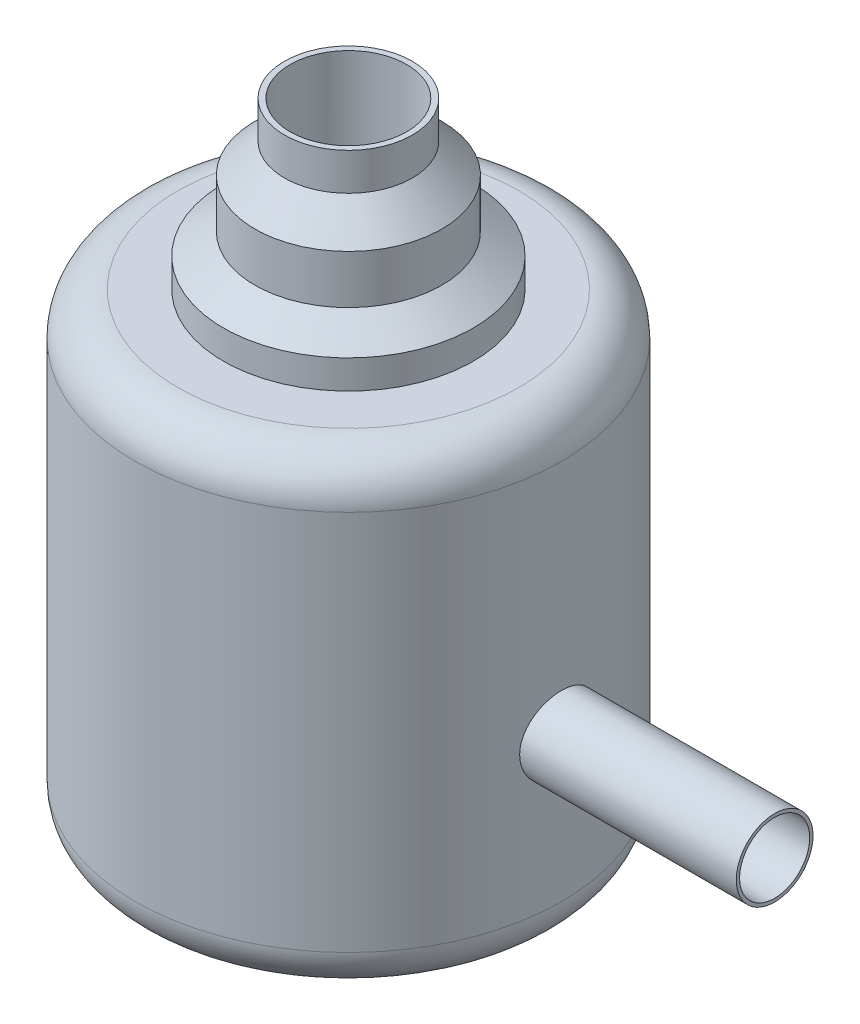
ISO-10303-21;
HEADER;
FILE_DESCRIPTION(('STEP AP214'),'2;1');
FILE_NAME('part.step','',(''),(''),'','','');
FILE_SCHEMA(('AUTOMOTIVE_DESIGN { 1 0 10303 214 1 1 1 1 }'));
ENDSEC;
DATA;
#1=APPLICATION_CONTEXT('core data for automotive mechanical design processes');
#2=APPLICATION_PROTOCOL_DEFINITION('international standard','automotive_design',2000,#1);
#3=PRODUCT_CONTEXT('',#1,'mechanical');
#4=PRODUCT('Part','Part','',(#3));
#5=PRODUCT_RELATED_PRODUCT_CATEGORY('part','',(#4));
#6=PRODUCT_DEFINITION_FORMATION('','',#4);
#7=PRODUCT_DEFINITION_CONTEXT('part definition',#1,'design');
#8=PRODUCT_DEFINITION('design','',#6,#7);
#9=PRODUCT_DEFINITION_SHAPE('','',#8);
#10=(LENGTH_UNIT() NAMED_UNIT(*) SI_UNIT(.MILLI.,.METRE.));
#11=(NAMED_UNIT(*) PLANE_ANGLE_UNIT() SI_UNIT($,.RADIAN.));
#12=(NAMED_UNIT(*) SI_UNIT($,.STERADIAN.) SOLID_ANGLE_UNIT());
#13=UNCERTAINTY_MEASURE_WITH_UNIT(LENGTH_MEASURE(1.E-05),#10,'distance_accuracy_value','');
#14=(GEOMETRIC_REPRESENTATION_CONTEXT(3) GLOBAL_UNCERTAINTY_ASSIGNED_CONTEXT((#13)) GLOBAL_UNIT_ASSIGNED_CONTEXT((#10,
#11,#12)) REPRESENTATION_CONTEXT('',''));
#15=CARTESIAN_POINT('',(0.,0.,0.));
#16=DIRECTION('',(0.,0.,1.));
#17=DIRECTION('',(1.,0.,0.));
#18=AXIS2_PLACEMENT_3D('',#15,#16,#17);
#19=CARTESIAN_POINT('',(0.,5.,0.));
#20=DIRECTION('',(0.,-1.,0.));
#21=DIRECTION('',(0.,0.,-1.));
#22=AXIS2_PLACEMENT_3D('',#19,#20,#21);
#23=CYLINDRICAL_SURFACE('',#22,2.5);
#24=CARTESIAN_POINT('',(0.,0.5,0.));
#25=DIRECTION('',(0.,1.,0.));
#26=DIRECTION('',(0.,0.,1.));
#27=AXIS2_PLACEMENT_3D('',#24,#25,#26);
#28=CIRCLE('',#27,2.5);
#29=CARTESIAN_POINT('',(0.,0.5,2.5));
#30=VERTEX_POINT('',#29);
#31=EDGE_CURVE('E85',#30,#30,#28,.T.);
#32=ORIENTED_EDGE('',*,*,#31,.T.);
#33=EDGE_LOOP('',(#32));
#34=FACE_BOUND('',#33,.T.);
#35=CARTESIAN_POINT('',(0.,4.97145984724777,0.));
#36=DIRECTION('',(0.,-1.,0.));
#37=DIRECTION('',(0.,0.,-1.));
#38=AXIS2_PLACEMENT_3D('',#35,#36,#37);
#39=CIRCLE('',#38,2.5);
#40=CARTESIAN_POINT('',(0.,4.97145984724777,-2.5));
#41=VERTEX_POINT('',#40);
#42=EDGE_CURVE('E88',#41,#41,#39,.T.);
#43=ORIENTED_EDGE('',*,*,#42,.T.);
#44=EDGE_LOOP('',(#43));
#45=FACE_BOUND('',#44,.T.);
#46=CARTESIAN_POINT('',(2.45916652547159,2.19465586332906,0.45));
#47=CARTESIAN_POINT('',(2.45916700009061,2.16959983407843,0.449999020788159));
#48=CARTESIAN_POINT('',(2.45955361857294,2.14453088130413,0.447900222638888));
#49=CARTESIAN_POINT('',(2.46105658666532,2.09509855430194,0.43956538979337));
#50=CARTESIAN_POINT('',(2.46217357539124,2.07073581757099,0.43332573153543));
#51=CARTESIAN_POINT('',(2.46500677092388,2.02343837328657,0.416905904971294));
#52=CARTESIAN_POINT('',(2.46672244087545,2.00050240794453,0.406729266186498));
#53=CARTESIAN_POINT('',(2.47055905098873,1.95666521118463,0.382733507034905));
#54=CARTESIAN_POINT('',(2.47267995433461,1.93576379518632,0.368914717517537));
#55=CARTESIAN_POINT('',(2.47711525388808,1.8963471986754,0.337857811883215));
#56=CARTESIAN_POINT('',(2.47943141528989,1.87785876164908,0.320586000807864));
#57=CARTESIAN_POINT('',(2.48398063455014,1.84402568339021,0.283186161317114));
#58=CARTESIAN_POINT('',(2.48621368714803,1.82868124088745,0.263057952486762));
#59=CARTESIAN_POINT('',(2.49036391293326,1.80147001055444,0.220341884816333));
#60=CARTESIAN_POINT('',(2.49227876542636,1.78962831944812,0.197737793963179));
#61=CARTESIAN_POINT('',(2.49555712244365,1.76992028191585,0.150820889649385));
#62=CARTESIAN_POINT('',(2.49692066874237,1.76205363427475,0.126508205819139));
#63=CARTESIAN_POINT('',(2.49893031295676,1.750601358274,0.0771411136896991));
#64=CARTESIAN_POINT('',(2.49958395261316,1.74697069724815,0.0520974642176861));
#65=CARTESIAN_POINT('',(2.50012609993544,1.74395324591702,0.00174852436273861));
#66=CARTESIAN_POINT('',(2.50001466785593,1.74456612140435,-0.0235567452590941));
#67=CARTESIAN_POINT('',(2.49904514916907,1.7499835916684,-0.0734021195457861));
#68=CARTESIAN_POINT('',(2.4981956983036,1.75473970707486,-0.0979476853601132));
#69=CARTESIAN_POINT('',(2.49585524820727,1.76823210000699,-0.14588656931623));
#70=CARTESIAN_POINT('',(2.49436422697923,1.77696851400365,-0.169279847919509));
#71=CARTESIAN_POINT('',(2.49089362923467,1.79822043892388,-0.214392052086347));
#72=CARTESIAN_POINT('',(2.48891152865838,1.81075555118634,-0.236101541541632));
#73=CARTESIAN_POINT('',(2.4846783558396,1.83923463588216,-0.277127122040465));
#74=CARTESIAN_POINT('',(2.48242725832428,1.85517892872631,-0.296442987850312));
#75=CARTESIAN_POINT('',(2.47786824428208,1.89029158077876,-0.332419962120039));
#76=CARTESIAN_POINT('',(2.47555997441616,1.90950233968338,-0.349039671120024));
#77=CARTESIAN_POINT('',(2.47117733103908,1.95046076011608,-0.378827096388199));
#78=CARTESIAN_POINT('',(2.46910296044174,1.97220845324134,-0.391994769655088));
#79=CARTESIAN_POINT('',(2.46542258637708,2.01767571911762,-0.414514765312475));
#80=CARTESIAN_POINT('',(2.4638172750181,2.04139814002303,-0.423861457781443));
#81=CARTESIAN_POINT('',(2.4612676698828,2.09011189304201,-0.43842520384135));
#82=CARTESIAN_POINT('',(2.46032330750784,2.11510309318254,-0.443642686002587));
#83=CARTESIAN_POINT('',(2.45921598987445,2.16527276155181,-0.449740266533624));
#84=CARTESIAN_POINT('',(2.45904235124834,2.19044379321729,-0.450679670168357));
#85=CARTESIAN_POINT('',(2.45946760229543,2.24058317429225,-0.448353053755119));
#86=CARTESIAN_POINT('',(2.46006645691192,2.26555153284755,-0.445087224545904));
#87=CARTESIAN_POINT('',(2.4619592973222,2.3143843032453,-0.434493631837015));
#88=CARTESIAN_POINT('',(2.46324801815449,2.33825560863319,-0.427196620425268));
#89=CARTESIAN_POINT('',(2.46637089326836,2.38443669808101,-0.408780286466631));
#90=CARTESIAN_POINT('',(2.46820508497229,2.40674637487469,-0.397660701661594));
#91=CARTESIAN_POINT('',(2.47223674833291,2.44943318438501,-0.37177707843621));
#92=CARTESIAN_POINT('',(2.47443789168986,2.46978712478758,-0.356975374196626));
#93=CARTESIAN_POINT('',(2.47894496626529,2.50774372543121,-0.324198805212407));
#94=CARTESIAN_POINT('',(2.48125090612368,2.5253461582924,-0.306223678482672));
#95=CARTESIAN_POINT('',(2.48574188391544,2.55751976946389,-0.267346423767884));
#96=CARTESIAN_POINT('',(2.48792509542031,2.57205118622935,-0.2464111465944));
#97=CARTESIAN_POINT('',(2.49189444607153,2.59739044345025,-0.202361997006681));
#98=CARTESIAN_POINT('',(2.49368059963721,2.60819841913188,-0.179248203749609));
#99=CARTESIAN_POINT('',(2.4966466975497,2.62572359073965,-0.131611066519807));
#100=CARTESIAN_POINT('',(2.4978296014407,2.63246078862532,-0.107095273334437));
#101=CARTESIAN_POINT('',(2.49946850276109,2.64171722293049,-0.0572569638817049));
#102=CARTESIAN_POINT('',(2.49992457042282,2.64423686688264,-0.0319345257995913));
#103=CARTESIAN_POINT('',(2.50005716694735,2.64497339657912,0.0184160473596289));
#104=CARTESIAN_POINT('',(2.499744605382,2.64325049855536,0.0434432929632689));
#105=CARTESIAN_POINT('',(2.49839758315684,2.63568212310757,0.0928456030303576));
#106=CARTESIAN_POINT('',(2.49736312828312,2.62983667872637,0.117220672719469));
#107=CARTESIAN_POINT('',(2.49468836827172,2.6142136896678,0.16459816177846));
#108=CARTESIAN_POINT('',(2.49304897750304,2.60444207747661,0.187602592249035));
#109=CARTESIAN_POINT('',(2.4893423651149,2.58125114741473,0.2316544998616));
#110=CARTESIAN_POINT('',(2.48727511788866,2.56783161120441,0.252701859765582));
#111=CARTESIAN_POINT('',(2.48290672924167,2.53751615980739,0.292543490433678));
#112=CARTESIAN_POINT('',(2.48060285013541,2.52057651210707,0.311304188805317));
#113=CARTESIAN_POINT('',(2.47603874783683,2.48379287882065,0.345737719781497));
#114=CARTESIAN_POINT('',(2.4737785350138,2.46394821275555,0.361409826882842));
#115=CARTESIAN_POINT('',(2.4695369702068,2.42171843437918,0.389344354011945));
#116=CARTESIAN_POINT('',(2.46755812621009,2.3993133402495,0.401576956414984));
#117=CARTESIAN_POINT('',(2.46413330431453,2.35273846508072,0.422085375613002));
#118=CARTESIAN_POINT('',(2.46268681271456,2.32857041236738,0.430365009188423));
#119=CARTESIAN_POINT('',(2.46079930219932,2.28604445432979,0.441006364175076));
#120=CARTESIAN_POINT('',(2.46019055933511,2.26793887413308,0.44437333754494));
#121=CARTESIAN_POINT('',(2.45937400145392,2.23144313497739,0.448870488586383));
#122=CARTESIAN_POINT('',(2.45916617698769,2.21305298273578,0.45000071897574));
#123=CARTESIAN_POINT('',(2.45916652547159,2.19465586332906,0.45));
#124=B_SPLINE_CURVE_WITH_KNOTS('',3,(#46,#47,#48,#49,#50,#51,#52,#53,#54,#55,#56,#57,#58,#59,
#60,#61,#62,#63,#64,#65,#66,#67,#68,#69,#70,#71,#72,#73,#74,#75,#76,#77,#78,#79,#80,#81,#82,#83,
#84,#85,#86,#87,#88,#89,#90,#91,#92,#93,#94,#95,#96,#97,#98,#99,#100,#101,#102,#103,#104,#105,
#106,#107,#108,#109,#110,#111,#112,#113,#114,#115,#116,#117,#118,#119,#120,#121,#122,#123),
.UNSPECIFIED.,.T.,.F.,(4,2,2,2,2,2,2,2,2,2,2,2,2,2,2,2,2,2,2,2,2,2,2,2,2,2,2,2,2,2,2,2,2,2,2,2,
2,2,4),(0.,0.0751007823268403,0.150267370254431,0.22536672656481,0.300459263272543,
0.376323862117609,0.452193254834605,0.528593759262509,0.604988473453798,0.680563415899286,
0.756132406371251,0.830828875898624,0.905527906708146,0.980619145462742,1.05571744474902,
1.13187761485452,1.20803873362657,1.28431166897139,1.36057668691782,1.43578118997335,
1.51098228027423,1.58561746219842,1.66025776569654,1.7356954769807,1.81113941901613,
1.88750727069083,1.96387234858118,2.03985908536669,2.11583847930254,2.1907456970715,
2.26565231445467,2.3404461701604,2.41524450349772,2.49103454895586,2.56684237616233,
2.64328844261479,2.71966054670552,2.77480378632885,2.82994572626614),.UNSPECIFIED.);
#125=CARTESIAN_POINT('',(2.45916652547159,2.19465586332906,0.45));
#126=VERTEX_POINT('',#125);
#127=EDGE_CURVE('E11',#126,#126,#124,.T.);
#128=ORIENTED_EDGE('',*,*,#127,.F.);
#129=EDGE_LOOP('',(#128));
#130=FACE_BOUND('',#129,.T.);
#131=ADVANCED_FACE('F36',(#34,#45,#130),#23,.T.);
#132=CARTESIAN_POINT('',(0.,2.41170500163225,0.));
#133=DIRECTION('',(0.,1.,0.));
#134=DIRECTION('',(0.,0.,1.));
#135=AXIS2_PLACEMENT_3D('',#132,#133,#134);
#136=CYLINDRICAL_SURFACE('',#135,0.684081366717814);
#137=CARTESIAN_POINT('',(0.,7.41170500163225,0.));
#138=DIRECTION('',(0.,1.,0.));
#139=DIRECTION('',(0.,0.,1.));
#140=AXIS2_PLACEMENT_3D('',#137,#138,#139);
#141=CIRCLE('',#140,0.684081366717814);
#142=CARTESIAN_POINT('',(0.,7.41170500163225,0.684081366717814));
#143=VERTEX_POINT('',#142);
#144=EDGE_CURVE('E109',#143,#143,#141,.T.);
#145=ORIENTED_EDGE('',*,*,#144,.T.);
#146=EDGE_LOOP('',(#145));
#147=FACE_BOUND('',#146,.T.);
#148=CARTESIAN_POINT('',(0.559086437618253,2.41170500163225,0.394194966433925));
#149=CARTESIAN_POINT('',(0.56819223479094,2.43505489974119,0.381309563478731));
#150=CARTESIAN_POINT('',(0.577944555971367,2.45707385288753,0.366506319229733));
#151=CARTESIAN_POINT('',(0.597740015819832,2.49824593037342,0.333232904689417));
#152=CARTESIAN_POINT('',(0.607784562028611,2.51738081872068,0.314740989167724));
#153=CARTESIAN_POINT('',(0.627035245591565,2.5523063066724,0.274401873820857));
#154=CARTESIAN_POINT('',(0.636240531191029,2.56809352984607,0.252551324443789));
#155=CARTESIAN_POINT('',(0.65282760549201,2.59570343765974,0.205894553807777));
#156=CARTESIAN_POINT('',(0.660213859502233,2.60753585649815,0.181095796405966));
#157=CARTESIAN_POINT('',(0.671807761588296,2.62582135707166,0.131302145757603));
#158=CARTESIAN_POINT('',(0.676226997863141,2.63263704561568,0.106491403274105));
#159=CARTESIAN_POINT('',(0.682283125938488,2.64193198227892,0.0557415003158792));
#160=CARTESIAN_POINT('',(0.683922771831197,2.64441552287653,0.0298034829488369));
#161=CARTESIAN_POINT('',(0.684195504829112,2.6448287372204,-0.0181007484025764));
#162=CARTESIAN_POINT('',(0.683253425931587,2.6434018818809,-0.0400623319784526));
#163=CARTESIAN_POINT('',(0.679330952566705,2.63740685730689,-0.0833600190429995));
#164=CARTESIAN_POINT('',(0.676350775121466,2.63283902253188,-0.104696188875139));
#165=CARTESIAN_POINT('',(0.668686372909232,2.62091222057526,-0.145792253349567));
#166=CARTESIAN_POINT('',(0.664034943245019,2.61360686099313,-0.165574114882565));
#167=CARTESIAN_POINT('',(0.653371400153962,2.59649120105742,-0.203627445321289));
#168=CARTESIAN_POINT('',(0.647358589755277,2.58667961728753,-0.22189813400315));
#169=CARTESIAN_POINT('',(0.633579117965742,2.5635088131384,-0.258802382749796));
#170=CARTESIAN_POINT('',(0.625688002002732,2.54986289942897,-0.277208565578021));
#171=CARTESIAN_POINT('',(0.609292642137944,2.52011609195786,-0.311597068852544));
#172=CARTESIAN_POINT('',(0.600788377168108,2.50401511381792,-0.327579305952426));
#173=CARTESIAN_POINT('',(0.586598522800745,2.47524775081241,-0.352135678063351));
#174=CARTESIAN_POINT('',(0.580902805015181,2.4631856693696,-0.361420823173144));
#175=CARTESIAN_POINT('',(0.569758352790097,2.43813371220926,-0.37874683777289));
#176=CARTESIAN_POINT('',(0.564309152095157,2.42514571889093,-0.386790132148439));
#177=CARTESIAN_POINT('',(0.559086437618253,2.41170500163225,-0.394194966433925));
#178=B_SPLINE_CURVE_WITH_KNOTS('',3,(#148,#149,#150,#151,#152,#153,#154,#155,#156,#157,#158,
#159,#160,#161,#162,#163,#164,#165,#166,#167,#168,#169,#170,#171,#172,#173,#174,#175,#176,#177),
.UNSPECIFIED.,.F.,.F.,(4,2,2,2,2,2,2,2,2,2,2,2,2,2,4),(0.,0.0844231429807033,0.169359519175955,
0.254381158351202,0.339191960475625,0.417022048415616,0.494774975060713,0.5605318853821,
0.626281794823936,0.690806263628637,0.755363841346448,0.827792817057505,0.900224282645873,
0.948912029608309,0.997503470739534),.UNSPECIFIED.);
#179=CARTESIAN_POINT('',(0.559086437618253,2.41170500163225,0.394194966433925));
#180=VERTEX_POINT('',#179);
#181=CARTESIAN_POINT('',(0.559086437618253,2.41170500163225,-0.394194966433925));
#182=VERTEX_POINT('',#181);
#183=EDGE_CURVE('E58',#180,#182,#178,.T.);
#184=ORIENTED_EDGE('',*,*,#183,.F.);
#185=CARTESIAN_POINT('',(0.,2.41170500163225,0.));
#186=DIRECTION('',(0.,1.,0.));
#187=DIRECTION('',(0.,0.,1.));
#188=AXIS2_PLACEMENT_3D('',#185,#186,#187);
#189=CIRCLE('',#188,0.684081366717814);
#190=EDGE_CURVE('E78',#182,#180,#189,.T.);
#191=ORIENTED_EDGE('',*,*,#190,.F.);
#192=EDGE_LOOP('',(#184,#191));
#193=FACE_BOUND('',#192,.T.);
#194=ADVANCED_FACE('F134',(#147,#193),#136,.F.);
#195=CARTESIAN_POINT('',(0.,2.41170500163225,0.));
#196=DIRECTION('',(0.,1.,0.));
#197=DIRECTION('',(0.,0.,1.));
#198=AXIS2_PLACEMENT_3D('',#195,#196,#197);
#199=PLANE('',#198);
#200=DIRECTION('',(0.,0.,-1.));
#201=VECTOR('',#200,1.);
#202=CARTESIAN_POINT('',(0.,2.41170500163225,0.));
#203=LINE('',#202,#201);
#204=CARTESIAN_POINT('',(0.,2.41170500163225,0.394194966433925));
#205=VERTEX_POINT('',#204);
#206=CARTESIAN_POINT('',(0.,2.41170500163225,-0.394194966433925));
#207=VERTEX_POINT('',#206);
#208=EDGE_CURVE('E64',#205,#207,#203,.T.);
#209=ORIENTED_EDGE('',*,*,#208,.T.);
#210=DIRECTION('',(-1.,0.,0.));
#211=VECTOR('',#210,1.);
#212=CARTESIAN_POINT('',(5.,2.41170500163225,-0.394194966433925));
#213=LINE('',#212,#211);
#214=EDGE_CURVE('E40',#207,#182,#213,.F.);
#215=ORIENTED_EDGE('',*,*,#214,.T.);
#216=ORIENTED_EDGE('',*,*,#190,.T.);
#217=DIRECTION('',(-1.,0.,0.));
#218=VECTOR('',#217,1.);
#219=CARTESIAN_POINT('',(5.,2.41170500163225,0.394194966433925));
#220=LINE('',#219,#218);
#221=EDGE_CURVE('E68',#180,#205,#220,.T.);
#222=ORIENTED_EDGE('',*,*,#221,.T.);
#223=EDGE_LOOP('',(#209,#215,#216,#222));
#224=FACE_BOUND('',#223,.T.);
#225=ADVANCED_FACE('F76',(#224),#199,.T.);
#226=CARTESIAN_POINT('',(0.,0.,0.));
#227=DIRECTION('',(0.,1.,0.));
#228=DIRECTION('',(0.,0.,1.));
#229=AXIS2_PLACEMENT_3D('',#226,#227,#228);
#230=PLANE('',#229);
#231=CARTESIAN_POINT('',(0.,0.,0.));
#232=DIRECTION('',(0.,1.,0.));
#233=DIRECTION('',(0.,0.,1.));
#234=AXIS2_PLACEMENT_3D('',#231,#232,#233);
#235=CIRCLE('',#234,2.);
#236=CARTESIAN_POINT('',(0.,0.,2.));
#237=VERTEX_POINT('',#236);
#238=EDGE_CURVE('E82',#237,#237,#235,.F.);
#239=ORIENTED_EDGE('',*,*,#238,.T.);
#240=EDGE_LOOP('',(#239));
#241=FACE_BOUND('',#240,.T.);
#242=ADVANCED_FACE('F133',(#241),#230,.F.);
#243=CARTESIAN_POINT('',(0.,7.41170500163225,0.));
#244=DIRECTION('',(0.,-1.,0.));
#245=DIRECTION('',(0.,0.,-1.));
#246=AXIS2_PLACEMENT_3D('',#243,#244,#245);
#247=PLANE('',#246);
#248=ORIENTED_EDGE('',*,*,#144,.F.);
#249=EDGE_LOOP('',(#248));
#250=FACE_BOUND('',#249,.T.);
#251=CARTESIAN_POINT('',(0.,7.41170500163225,0.));
#252=DIRECTION('',(0.,-1.,0.));
#253=DIRECTION('',(0.,0.,-1.));
#254=AXIS2_PLACEMENT_3D('',#251,#252,#253);
#255=CIRCLE('',#254,0.75);
#256=CARTESIAN_POINT('',(0.,7.41170500163225,-0.75));
#257=VERTEX_POINT('',#256);
#258=EDGE_CURVE('E91',#257,#257,#255,.T.);
#259=ORIENTED_EDGE('',*,*,#258,.F.);
#260=EDGE_LOOP('',(#259));
#261=FACE_BOUND('',#260,.T.);
#262=ADVANCED_FACE('F163',(#250,#261),#247,.F.);
#263=CARTESIAN_POINT('',(0.,0.,0.));
#264=DIRECTION('',(0.,-1.,0.));
#265=DIRECTION('',(0.,0.,-1.));
#266=AXIS2_PLACEMENT_3D('',#263,#264,#265);
#267=CYLINDRICAL_SURFACE('',#266,0.75);
#268=CARTESIAN_POINT('',(0.,6.97506156400285,0.));
#269=DIRECTION('',(0.,-1.,0.));
#270=DIRECTION('',(0.,0.,-1.));
#271=AXIS2_PLACEMENT_3D('',#268,#269,#270);
#272=CIRCLE('',#271,0.75);
#273=CARTESIAN_POINT('',(0.,6.97506156400285,-0.75));
#274=VERTEX_POINT('',#273);
#275=EDGE_CURVE('E94',#274,#274,#272,.T.);
#276=ORIENTED_EDGE('',*,*,#275,.F.);
#277=EDGE_LOOP('',(#276));
#278=FACE_BOUND('',#277,.T.);
#279=ORIENTED_EDGE('',*,*,#258,.T.);
#280=EDGE_LOOP('',(#279));
#281=FACE_BOUND('',#280,.T.);
#282=ADVANCED_FACE('F159',(#278,#281),#267,.T.);
#283=CARTESIAN_POINT('',(0.,6.97506156400285,0.));
#284=DIRECTION('',(0.,-1.,0.));
#285=DIRECTION('',(0.,0.,-1.));
#286=AXIS2_PLACEMENT_3D('',#283,#284,#285);
#287=CONICAL_SURFACE('',#286,0.75,0.785398163397423);
#288=CARTESIAN_POINT('',(0.,6.6291689962043,0.));
#289=DIRECTION('',(0.,-1.,0.));
#290=DIRECTION('',(0.,0.,-1.));
#291=AXIS2_PLACEMENT_3D('',#288,#289,#290);
#292=CIRCLE('',#291,1.09589256779853);
#293=CARTESIAN_POINT('',(0.,6.6291689962043,-1.09589256779853));
#294=VERTEX_POINT('',#293);
#295=EDGE_CURVE('E97',#294,#294,#292,.T.);
#296=ORIENTED_EDGE('',*,*,#295,.F.);
#297=EDGE_LOOP('',(#296));
#298=FACE_BOUND('',#297,.T.);
#299=ORIENTED_EDGE('',*,*,#275,.T.);
#300=EDGE_LOOP('',(#299));
#301=FACE_BOUND('',#300,.T.);
#302=ADVANCED_FACE('F155',(#298,#301),#287,.T.);
#303=CARTESIAN_POINT('',(0.,0.,0.));
#304=DIRECTION('',(0.,-1.,0.));
#305=DIRECTION('',(0.,0.,-1.));
#306=AXIS2_PLACEMENT_3D('',#303,#304,#305);
#307=CYLINDRICAL_SURFACE('',#306,1.09589256779853);
#308=CARTESIAN_POINT('',(0.,6.05842736234468,0.));
#309=DIRECTION('',(0.,-1.,0.));
#310=DIRECTION('',(0.,0.,-1.));
#311=AXIS2_PLACEMENT_3D('',#308,#309,#310);
#312=CIRCLE('',#311,1.09589256779853);
#313=CARTESIAN_POINT('',(0.,6.05842736234468,-1.09589256779853));
#314=VERTEX_POINT('',#313);
#315=EDGE_CURVE('E100',#314,#314,#312,.T.);
#316=ORIENTED_EDGE('',*,*,#315,.F.);
#317=EDGE_LOOP('',(#316));
#318=FACE_BOUND('',#317,.T.);
#319=ORIENTED_EDGE('',*,*,#295,.T.);
#320=EDGE_LOOP('',(#319));
#321=FACE_BOUND('',#320,.T.);
#322=ADVANCED_FACE('F151',(#318,#321),#307,.T.);
#323=CARTESIAN_POINT('',(0.,6.05842736234468,0.));
#324=DIRECTION('',(0.,-1.,0.));
#325=DIRECTION('',(0.,0.,-1.));
#326=AXIS2_PLACEMENT_3D('',#323,#324,#325);
#327=CONICAL_SURFACE('',#326,1.09589256779853,0.977974870913565);
#328=CARTESIAN_POINT('',(0.,5.80916718470078,0.));
#329=DIRECTION('',(0.,-1.,0.));
#330=DIRECTION('',(0.,0.,-1.));
#331=AXIS2_PLACEMENT_3D('',#328,#329,#330);
#332=CIRCLE('',#331,1.4659070882723);
#333=CARTESIAN_POINT('',(0.,5.80916718470078,-1.4659070882723));
#334=VERTEX_POINT('',#333);
#335=EDGE_CURVE('E103',#334,#334,#332,.T.);
#336=ORIENTED_EDGE('',*,*,#335,.F.);
#337=EDGE_LOOP('',(#336));
#338=FACE_BOUND('',#337,.T.);
#339=ORIENTED_EDGE('',*,*,#315,.T.);
#340=EDGE_LOOP('',(#339));
#341=FACE_BOUND('',#340,.T.);
#342=ADVANCED_FACE('F147',(#338,#341),#327,.T.);
#343=CARTESIAN_POINT('',(0.,0.,0.));
#344=DIRECTION('',(0.,-1.,0.));
#345=DIRECTION('',(0.,0.,-1.));
#346=AXIS2_PLACEMENT_3D('',#343,#344,#345);
#347=CYLINDRICAL_SURFACE('',#346,1.4659070882723);
#348=CARTESIAN_POINT('',(0.,5.47145984724777,0.));
#349=DIRECTION('',(0.,-1.,0.));
#350=DIRECTION('',(0.,0.,-1.));
#351=AXIS2_PLACEMENT_3D('',#348,#349,#350);
#352=CIRCLE('',#351,1.4659070882723);
#353=CARTESIAN_POINT('',(0.,5.47145984724777,-1.4659070882723));
#354=VERTEX_POINT('',#353);
#355=EDGE_CURVE('E106',#354,#354,#352,.T.);
#356=ORIENTED_EDGE('',*,*,#355,.F.);
#357=EDGE_LOOP('',(#356));
#358=FACE_BOUND('',#357,.T.);
#359=ORIENTED_EDGE('',*,*,#335,.T.);
#360=EDGE_LOOP('',(#359));
#361=FACE_BOUND('',#360,.T.);
#362=ADVANCED_FACE('F143',(#358,#361),#347,.T.);
#363=CARTESIAN_POINT('',(-1.4659070882723,5.47145984724777,0.));
#364=DIRECTION('',(0.,-1.,0.));
#365=DIRECTION('',(0.,0.,-1.));
#366=AXIS2_PLACEMENT_3D('',#363,#364,#365);
#367=PLANE('',#366);
#368=CARTESIAN_POINT('',(0.,5.47145984724777,0.));
#369=DIRECTION('',(0.,-1.,0.));
#370=DIRECTION('',(0.,0.,-1.));
#371=AXIS2_PLACEMENT_3D('',#368,#369,#370);
#372=CIRCLE('',#371,2.);
#373=CARTESIAN_POINT('',(0.,5.47145984724777,-2.));
#374=VERTEX_POINT('',#373);
#375=EDGE_CURVE('E69',#374,#374,#372,.F.);
#376=ORIENTED_EDGE('',*,*,#375,.T.);
#377=EDGE_LOOP('',(#376));
#378=FACE_BOUND('',#377,.T.);
#379=ORIENTED_EDGE('',*,*,#355,.T.);
#380=EDGE_LOOP('',(#379));
#381=FACE_BOUND('',#380,.T.);
#382=ADVANCED_FACE('F139',(#378,#381),#367,.F.);
#383=CARTESIAN_POINT('',(0.,0.5,0.));
#384=DIRECTION('',(0.,1.,0.));
#385=DIRECTION('',(0.,0.,1.));
#386=AXIS2_PLACEMENT_3D('',#383,#384,#385);
#387=TOROIDAL_SURFACE('',#386,2.,0.5);
#388=ORIENTED_EDGE('',*,*,#238,.F.);
#389=EDGE_LOOP('',(#388));
#390=FACE_BOUND('',#389,.T.);
#391=ORIENTED_EDGE('',*,*,#31,.F.);
#392=EDGE_LOOP('',(#391));
#393=FACE_BOUND('',#392,.T.);
#394=ADVANCED_FACE('F142',(#390,#393),#387,.T.);
#395=CARTESIAN_POINT('',(0.,4.97145984724777,0.));
#396=DIRECTION('',(0.,-1.,0.));
#397=DIRECTION('',(0.,0.,-1.));
#398=AXIS2_PLACEMENT_3D('',#395,#396,#397);
#399=TOROIDAL_SURFACE('',#398,2.,0.5);
#400=ORIENTED_EDGE('',*,*,#375,.F.);
#401=EDGE_LOOP('',(#400));
#402=FACE_BOUND('',#401,.T.);
#403=ORIENTED_EDGE('',*,*,#42,.F.);
#404=EDGE_LOOP('',(#403));
#405=FACE_BOUND('',#404,.T.);
#406=ADVANCED_FACE('F38',(#402,#405),#399,.T.);
#407=CARTESIAN_POINT('',(0.,2.19465586332906,0.));
#408=DIRECTION('',(1.,0.,0.));
#409=DIRECTION('',(0.,0.,-1.));
#410=AXIS2_PLACEMENT_3D('',#407,#408,#409);
#411=PLANE('',#410);
#412=ORIENTED_EDGE('',*,*,#208,.F.);
#413=CARTESIAN_POINT('',(0.,2.19465586332906,0.));
#414=DIRECTION('',(1.,0.,0.));
#415=DIRECTION('',(0.,0.,-1.));
#416=AXIS2_PLACEMENT_3D('',#413,#414,#415);
#417=CIRCLE('',#416,0.45);
#418=EDGE_CURVE('E51',#207,#205,#417,.T.);
#419=ORIENTED_EDGE('',*,*,#418,.F.);
#420=EDGE_LOOP('',(#412,#419));
#421=FACE_BOUND('',#420,.T.);
#422=ADVANCED_FACE('F65',(#421),#411,.F.);
#423=CARTESIAN_POINT('',(5.,2.19465586332906,0.));
#424=DIRECTION('',(-1.,0.,0.));
#425=DIRECTION('',(0.,0.,1.));
#426=AXIS2_PLACEMENT_3D('',#423,#424,#425);
#427=CYLINDRICAL_SURFACE('',#426,0.45);
#428=ORIENTED_EDGE('',*,*,#214,.F.);
#429=ORIENTED_EDGE('',*,*,#418,.T.);
#430=ORIENTED_EDGE('',*,*,#221,.F.);
#431=ORIENTED_EDGE('',*,*,#183,.T.);
#432=EDGE_LOOP('',(#428,#429,#430,#431));
#433=FACE_BOUND('',#432,.T.);
#434=ADVANCED_FACE('F71',(#433),#427,.T.);
#435=CARTESIAN_POINT('',(5.,2.19465586332906,0.));
#436=DIRECTION('',(1.,0.,0.));
#437=DIRECTION('',(0.,0.,-1.));
#438=AXIS2_PLACEMENT_3D('',#435,#436,#437);
#439=CIRCLE('',#438,0.45);
#440=CARTESIAN_POINT('',(5.,2.19465586332906,-0.45));
#441=VERTEX_POINT('',#440);
#442=EDGE_CURVE('E72',#441,#441,#439,.T.);
#443=ORIENTED_EDGE('',*,*,#442,.F.);
#444=EDGE_LOOP('',(#443));
#445=FACE_BOUND('',#444,.T.);
#446=ORIENTED_EDGE('',*,*,#127,.T.);
#447=EDGE_LOOP('',(#446));
#448=FACE_BOUND('',#447,.T.);
#449=ADVANCED_FACE('F129',(#445,#448),#427,.T.);
#450=CARTESIAN_POINT('',(5.,2.19465586332906,0.));
#451=DIRECTION('',(1.,0.,0.));
#452=DIRECTION('',(0.,0.,-1.));
#453=AXIS2_PLACEMENT_3D('',#450,#451,#452);
#454=PLANE('',#453);
#455=CARTESIAN_POINT('',(5.,2.19465586332906,0.));
#456=DIRECTION('',(1.,0.,0.));
#457=DIRECTION('',(0.,0.,-1.));
#458=AXIS2_PLACEMENT_3D('',#455,#456,#457);
#459=CIRCLE('',#458,0.411041125617825);
#460=CARTESIAN_POINT('',(5.,2.19465586332906,-0.411041125617825));
#461=VERTEX_POINT('',#460);
#462=EDGE_CURVE('E194',#461,#461,#459,.T.);
#463=ORIENTED_EDGE('',*,*,#462,.F.);
#464=EDGE_LOOP('',(#463));
#465=FACE_BOUND('',#464,.T.);
#466=ORIENTED_EDGE('',*,*,#442,.T.);
#467=EDGE_LOOP('',(#466));
#468=FACE_BOUND('',#467,.T.);
#469=ADVANCED_FACE('F182',(#465,#468),#454,.T.);
#470=CARTESIAN_POINT('',(1.,2.19465586332906,0.));
#471=DIRECTION('',(1.,0.,0.));
#472=DIRECTION('',(0.,0.,-1.));
#473=AXIS2_PLACEMENT_3D('',#470,#471,#472);
#474=CYLINDRICAL_SURFACE('',#473,0.411041125617825);
#475=CARTESIAN_POINT('',(1.,2.19465586332906,0.));
#476=DIRECTION('',(1.,0.,0.));
#477=DIRECTION('',(0.,0.,-1.));
#478=AXIS2_PLACEMENT_3D('',#475,#476,#477);
#479=CIRCLE('',#478,0.411041125617825);
#480=CARTESIAN_POINT('',(1.,2.19465586332906,-0.411041125617825));
#481=VERTEX_POINT('',#480);
#482=EDGE_CURVE('E73',#481,#481,#479,.T.);
#483=ORIENTED_EDGE('',*,*,#482,.F.);
#484=EDGE_LOOP('',(#483));
#485=FACE_BOUND('',#484,.T.);
#486=ORIENTED_EDGE('',*,*,#462,.T.);
#487=EDGE_LOOP('',(#486));
#488=FACE_BOUND('',#487,.T.);
#489=ADVANCED_FACE('F187',(#485,#488),#474,.F.);
#490=CARTESIAN_POINT('',(1.,2.19465586332906,0.));
#491=DIRECTION('',(1.,0.,0.));
#492=DIRECTION('',(0.,0.,-1.));
#493=AXIS2_PLACEMENT_3D('',#490,#491,#492);
#494=PLANE('',#493);
#495=ORIENTED_EDGE('',*,*,#482,.T.);
#496=EDGE_LOOP('',(#495));
#497=FACE_BOUND('',#496,.T.);
#498=ADVANCED_FACE('F200',(#497),#494,.T.);
#499=CLOSED_SHELL('',(#131,#194,#225,#242,#262,#282,#302,#322,#342,#362,#382,#394,#406,#422,
#434,#449,#469,#489,#498));
#500=MANIFOLD_SOLID_BREP('B2',#499);
#501=ADVANCED_BREP_SHAPE_REPRESENTATION('',(#18,#500),#14);
#502=SHAPE_DEFINITION_REPRESENTATION(#9,#501);
ENDSEC;
END-ISO-10303-21;
